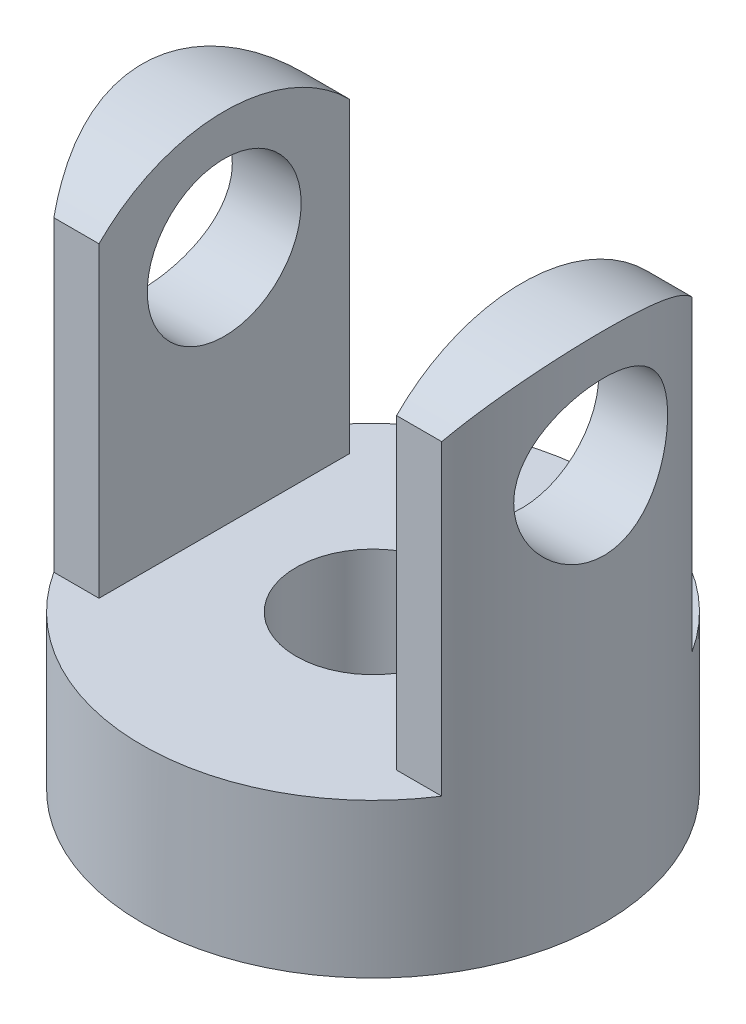
ISO-10303-21;
HEADER;
FILE_DESCRIPTION(('STEP AP214'),'2;1');
FILE_NAME('part.step','',(''),(''),'','','');
FILE_SCHEMA(('AUTOMOTIVE_DESIGN { 1 0 10303 214 1 1 1 1 }'));
ENDSEC;
DATA;
#1=APPLICATION_CONTEXT('core data for automotive mechanical design processes');
#2=APPLICATION_PROTOCOL_DEFINITION('international standard','automotive_design',2000,#1);
#3=PRODUCT_CONTEXT('',#1,'mechanical');
#4=PRODUCT('Part','Part','',(#3));
#5=PRODUCT_RELATED_PRODUCT_CATEGORY('part','',(#4));
#6=PRODUCT_DEFINITION_FORMATION('','',#4);
#7=PRODUCT_DEFINITION_CONTEXT('part definition',#1,'design');
#8=PRODUCT_DEFINITION('design','',#6,#7);
#9=PRODUCT_DEFINITION_SHAPE('','',#8);
#10=(LENGTH_UNIT() NAMED_UNIT(*) SI_UNIT(.MILLI.,.METRE.));
#11=(NAMED_UNIT(*) PLANE_ANGLE_UNIT() SI_UNIT($,.RADIAN.));
#12=(NAMED_UNIT(*) SI_UNIT($,.STERADIAN.) SOLID_ANGLE_UNIT());
#13=UNCERTAINTY_MEASURE_WITH_UNIT(LENGTH_MEASURE(1.E-05),#10,'distance_accuracy_value','');
#14=(GEOMETRIC_REPRESENTATION_CONTEXT(3) GLOBAL_UNCERTAINTY_ASSIGNED_CONTEXT((#13)) GLOBAL_UNIT_ASSIGNED_CONTEXT((#10,
#11,#12)) REPRESENTATION_CONTEXT('',''));
#15=CARTESIAN_POINT('',(0.,0.,0.));
#16=DIRECTION('',(0.,0.,1.));
#17=DIRECTION('',(1.,0.,0.));
#18=AXIS2_PLACEMENT_3D('',#15,#16,#17);
#19=CARTESIAN_POINT('',(0.,3.,0.));
#20=DIRECTION('',(0.,-1.,0.));
#21=DIRECTION('',(0.,0.,-1.));
#22=AXIS2_PLACEMENT_3D('',#19,#20,#21);
#23=CYLINDRICAL_SURFACE('',#22,4.5);
#24=CARTESIAN_POINT('',(4.24264068711929,7.7,1.5));
#25=CARTESIAN_POINT('',(4.24264041795651,7.61829773774589,1.50000038692157));
#26=CARTESIAN_POINT('',(4.24502653936286,7.53659780026461,1.49330217552829));
#27=CARTESIAN_POINT('',(4.25426361121882,7.37561836850863,1.46677669753321));
#28=CARTESIAN_POINT('',(4.26111529713283,7.2963392751913,1.4469472682526));
#29=CARTESIAN_POINT('',(4.27842305533187,7.14255966050407,1.39493322852736));
#30=CARTESIAN_POINT('',(4.28887205956983,7.06805010583593,1.36277283210487));
#31=CARTESIAN_POINT('',(4.31218683015487,6.92545992717806,1.28709244266207));
#32=CARTESIAN_POINT('',(4.32505312955418,6.85738072616955,1.24356994329028));
#33=CARTESIAN_POINT('',(4.3523173411121,6.72692005649253,1.14457671966432));
#34=CARTESIAN_POINT('',(4.36675342266966,6.66482685699241,1.08873651206688));
#35=CARTESIAN_POINT('',(4.39520797201504,6.55068979816304,0.967481500821593));
#36=CARTESIAN_POINT('',(4.40922637243442,6.49864755262645,0.902065162578564));
#37=CARTESIAN_POINT('',(4.43570800382699,6.40478165400561,0.761406761947516));
#38=CARTESIAN_POINT('',(4.44812111552408,6.36326004407306,0.685952866836789));
#39=CARTESIAN_POINT('',(4.46954380156474,6.29361262230873,0.528646834481212));
#40=CARTESIAN_POINT('',(4.47855429304502,6.26548320023464,0.446796428530819));
#41=CARTESIAN_POINT('',(4.49188613147861,6.22439621805141,0.282043226150242));
#42=CARTESIAN_POINT('',(4.49635972166341,6.21094483061449,0.199276132279452));
#43=CARTESIAN_POINT('',(4.5006541232737,6.19802555995901,0.0325468122361365));
#44=CARTESIAN_POINT('',(4.50047613394336,6.19855407252137,-0.0514151003158389));
#45=CARTESIAN_POINT('',(4.49559059428104,6.21326638184905,-0.214655272790726));
#46=CARTESIAN_POINT('',(4.49106097132703,6.22691379271176,-0.2939880728875));
#47=CARTESIAN_POINT('',(4.47820451009571,6.26658947147068,-0.449165158233241));
#48=CARTESIAN_POINT('',(4.46987741446672,6.29261857846963,-0.525009206668763));
#49=CARTESIAN_POINT('',(4.45013505439938,6.3566319759592,-0.67222871226302));
#50=CARTESIAN_POINT('',(4.43868063786404,6.39476890782017,-0.743532331453497));
#51=CARTESIAN_POINT('',(4.41387589557997,6.48178955817259,-0.878886488290753));
#52=CARTESIAN_POINT('',(4.40052504300777,6.53067626498996,-0.942935001577153));
#53=CARTESIAN_POINT('',(4.37259287776335,6.64051159019111,-1.06515129982786));
#54=CARTESIAN_POINT('',(4.35798322759,6.70191973676816,-1.12290023560133));
#55=CARTESIAN_POINT('',(4.32971002867667,6.83367308858399,-1.22741588939383));
#56=CARTESIAN_POINT('',(4.31604662597175,6.90401966856986,-1.27418091490951));
#57=CARTESIAN_POINT('',(4.29105787703297,7.05298043842312,-1.3559811825641));
#58=CARTESIAN_POINT('',(4.27976864008232,7.13169819705172,-1.39083969547657));
#59=CARTESIAN_POINT('',(4.26122476317449,7.29435709139939,-1.44666478994926));
#60=CARTESIAN_POINT('',(4.25396843251835,7.37829602183274,-1.46763719363329));
#61=CARTESIAN_POINT('',(4.24469454453105,7.54495753310093,-1.49424192313571));
#62=CARTESIAN_POINT('',(4.24245540472709,7.62756413711859,-1.50052364325862));
#63=CARTESIAN_POINT('',(4.24285008094201,7.79266422367556,-1.49940815836741));
#64=CARTESIAN_POINT('',(4.24548301189152,7.87515772403714,-1.49201343784089));
#65=CARTESIAN_POINT('',(4.25510427134068,8.03473544856674,-1.46433847732774));
#66=CARTESIAN_POINT('',(4.2619398816089,8.11190814522596,-1.44450959097083));
#67=CARTESIAN_POINT('',(4.27902830506905,8.26181540935908,-1.39307079384089));
#68=CARTESIAN_POINT('',(4.2892817240236,8.33454918738625,-1.36145879454518));
#69=CARTESIAN_POINT('',(4.31245316393577,8.47607063127041,-1.28621151110835));
#70=CARTESIAN_POINT('',(4.32544538498415,8.54465996396268,-1.24222667753773));
#71=CARTESIAN_POINT('',(4.35248653096476,8.6737190785756,-1.14387844583635));
#72=CARTESIAN_POINT('',(4.36653576665699,8.73418645799184,-1.08951198824817));
#73=CARTESIAN_POINT('',(4.39492557956766,8.84829197613595,-0.968837558850481));
#74=CARTESIAN_POINT('',(4.40924765366843,8.90146158502827,-0.902080905819974));
#75=CARTESIAN_POINT('',(4.43590277419665,8.99587421352207,-0.760240937100383));
#76=CARTESIAN_POINT('',(4.44823589126543,9.03711765674364,-0.685157917296826));
#77=CARTESIAN_POINT('',(4.46946608715904,9.10613015729257,-0.529169793648441));
#78=CARTESIAN_POINT('',(4.47838545006797,9.1339869157221,-0.448306684981793));
#79=CARTESIAN_POINT('',(4.49187916256662,9.17559161309016,-0.282687698769022));
#80=CARTESIAN_POINT('',(4.49645508051028,9.18934464482076,-0.197933237930832));
#81=CARTESIAN_POINT('',(4.50062794854384,9.20189311640846,-0.031223003790059));
#82=CARTESIAN_POINT('',(4.50044880134159,9.20136118089857,0.0506770858800301));
#83=CARTESIAN_POINT('',(4.49568294779097,9.18701403778039,0.213166717500263));
#84=CARTESIAN_POINT('',(4.49109659900364,9.17319990777085,0.293756365228587));
#85=CARTESIAN_POINT('',(4.47811372431618,9.13312664813606,0.45006317914809));
#86=CARTESIAN_POINT('',(4.46977887541723,9.1070686769706,0.525837406369186));
#87=CARTESIAN_POINT('',(4.45015741056742,9.04343370335427,0.671967526409695));
#88=CARTESIAN_POINT('',(4.43887026072025,9.00585461720448,0.74232243621365));
#89=CARTESIAN_POINT('',(4.41398803241821,8.91864573184699,0.87845102446318));
#90=CARTESIAN_POINT('',(4.4003230873789,8.86862197192754,0.943959377336413));
#91=CARTESIAN_POINT('',(4.37239483187819,8.75861391326571,1.06587153940864));
#92=CARTESIAN_POINT('',(4.35813133159646,8.69862643660591,1.12227243243689));
#93=CARTESIAN_POINT('',(4.32994919738397,8.56758596661958,1.22661271324968));
#94=CARTESIAN_POINT('',(4.31606591982946,8.49619173353504,1.27413444899685));
#95=CARTESIAN_POINT('',(4.29090289984523,8.34599835964583,1.35647151495167));
#96=CARTESIAN_POINT('',(4.27962247741874,8.2672011604555,1.39129016522921));
#97=CARTESIAN_POINT('',(4.26152001309772,8.10805726397655,1.44576574230625));
#98=CARTESIAN_POINT('',(4.25451949285773,8.02794160471195,1.46603686372428));
#99=CARTESIAN_POINT('',(4.24508075309277,7.86521592429995,1.4931514802239));
#100=CARTESIAN_POINT('',(4.24264095926192,7.78260677388394,1.49999960879489));
#101=CARTESIAN_POINT('',(4.24264068711929,7.7,1.5));
#102=B_SPLINE_CURVE_WITH_KNOTS('',3,(#24,#25,#26,#27,#28,#29,#30,#31,#32,#33,#34,#35,#36,#37,
#38,#39,#40,#41,#42,#43,#44,#45,#46,#47,#48,#49,#50,#51,#52,#53,#54,#55,#56,#57,#58,#59,#60,#61,
#62,#63,#64,#65,#66,#67,#68,#69,#70,#71,#72,#73,#74,#75,#76,#77,#78,#79,#80,#81,#82,#83,#84,#85,
#86,#87,#88,#89,#90,#91,#92,#93,#94,#95,#96,#97,#98,#99,#100,#101),.UNSPECIFIED.,.T.,.F.,(4,2,2,
2,2,2,2,2,2,2,2,2,2,2,2,2,2,2,2,2,2,2,2,2,2,2,2,2,2,2,2,2,2,2,2,2,2,2,4),(0.,0.244800877199033,
0.489642082522746,0.734004941251242,0.978421749278163,1.23152006141352,1.48465897757982,
1.74440259215486,2.00407614580184,2.25471478147401,2.50528879953491,2.74603507238354,
2.98679766283855,3.23072482290503,3.47471987811033,3.73020261545876,3.98572469418159,
4.24488959763007,4.50394577031475,4.75131437043211,4.99863803752402,5.23746593649716,
5.4763361871697,5.72278286600124,5.96930228489743,6.22768212253191,6.4860527813285,
6.74270686782829,6.99926824502787,7.24377127013005,7.48825446011223,7.72885434057197,
7.96949776141416,8.21903279277502,8.46864756645499,8.72803354100769,8.98735167396852,
9.23494818240588,9.48245920782247),.UNSPECIFIED.);
#103=CARTESIAN_POINT('',(4.24264068711929,7.7,1.5));
#104=VERTEX_POINT('',#103);
#105=EDGE_CURVE('E238',#104,#104,#102,.T.);
#106=ORIENTED_EDGE('',*,*,#105,.F.);
#107=EDGE_LOOP('',(#106));
#108=FACE_BOUND('',#107,.T.);
#109=CARTESIAN_POINT('',(0.,0.,0.));
#110=DIRECTION('',(0.,1.,0.));
#111=DIRECTION('',(0.,0.,1.));
#112=AXIS2_PLACEMENT_3D('',#109,#110,#111);
#113=CIRCLE('',#112,4.5);
#114=CARTESIAN_POINT('',(0.,0.,4.5));
#115=VERTEX_POINT('',#114);
#116=EDGE_CURVE('E121',#115,#115,#113,.T.);
#117=ORIENTED_EDGE('',*,*,#116,.T.);
#118=EDGE_LOOP('',(#117));
#119=FACE_BOUND('',#118,.T.);
#120=CARTESIAN_POINT('',(-4.24264068711929,7.7,-1.5));
#121=CARTESIAN_POINT('',(-4.24264041795651,7.78170226225411,-1.50000038692157));
#122=CARTESIAN_POINT('',(-4.24502653936286,7.86340219973539,-1.49330217552828));
#123=CARTESIAN_POINT('',(-4.25426361121882,8.02438163149137,-1.46677669753321));
#124=CARTESIAN_POINT('',(-4.26111529713283,8.10366072480871,-1.44694726825259));
#125=CARTESIAN_POINT('',(-4.27842305533187,8.25744033949593,-1.39493322852736));
#126=CARTESIAN_POINT('',(-4.28887205956983,8.33194989416408,-1.36277283210487));
#127=CARTESIAN_POINT('',(-4.31218683015487,8.47454007282194,-1.28709244266207));
#128=CARTESIAN_POINT('',(-4.32505312955419,8.54261927383045,-1.24356994329027));
#129=CARTESIAN_POINT('',(-4.3523173411121,8.67307994350747,-1.14457671966431));
#130=CARTESIAN_POINT('',(-4.36675342266966,8.73517314300759,-1.08873651206688));
#131=CARTESIAN_POINT('',(-4.39520797201504,8.84931020183696,-0.967481500821591));
#132=CARTESIAN_POINT('',(-4.40922637243442,8.90135244737355,-0.902065162578562));
#133=CARTESIAN_POINT('',(-4.43570800382699,8.99521834599439,-0.761406761947514));
#134=CARTESIAN_POINT('',(-4.44812111552408,9.03673995592694,-0.685952866836787));
#135=CARTESIAN_POINT('',(-4.46954380156474,9.10638737769126,-0.52864683448121));
#136=CARTESIAN_POINT('',(-4.47855429304502,9.13451679976536,-0.446796428530817));
#137=CARTESIAN_POINT('',(-4.49188613147861,9.17560378194859,-0.28204322615024));
#138=CARTESIAN_POINT('',(-4.49635972166341,9.18905516938551,-0.19927613227945));
#139=CARTESIAN_POINT('',(-4.5006541232737,9.20197444004099,-0.0325468122361343));
#140=CARTESIAN_POINT('',(-4.50047613394336,9.20144592747863,0.0514151003158412));
#141=CARTESIAN_POINT('',(-4.49559059428104,9.18673361815095,0.214655272790728));
#142=CARTESIAN_POINT('',(-4.49106097132703,9.17308620728824,0.293988072887502));
#143=CARTESIAN_POINT('',(-4.47820451009571,9.13341052852932,0.449165158233243));
#144=CARTESIAN_POINT('',(-4.46987741446672,9.10738142153037,0.525009206668765));
#145=CARTESIAN_POINT('',(-4.45013505439938,9.04336802404081,0.672228712263021));
#146=CARTESIAN_POINT('',(-4.43868063786404,9.00523109217983,0.743532331453498));
#147=CARTESIAN_POINT('',(-4.41387589557997,8.91821044182741,0.878886488290755));
#148=CARTESIAN_POINT('',(-4.40052504300777,8.86932373501004,0.942935001577155));
#149=CARTESIAN_POINT('',(-4.37259287776335,8.7594884098089,1.06515129982786));
#150=CARTESIAN_POINT('',(-4.35798322759,8.69808026323184,1.12290023560133));
#151=CARTESIAN_POINT('',(-4.32971002867667,8.56632691141601,1.22741588939384));
#152=CARTESIAN_POINT('',(-4.31604662597175,8.49598033143014,1.27418091490951));
#153=CARTESIAN_POINT('',(-4.29105787703296,8.34701956157688,1.3559811825641));
#154=CARTESIAN_POINT('',(-4.27976864008232,8.26830180294828,1.39083969547658));
#155=CARTESIAN_POINT('',(-4.26122476317448,8.10564290860061,1.44666478994926));
#156=CARTESIAN_POINT('',(-4.25396843251835,8.02170397816726,1.4676371936333));
#157=CARTESIAN_POINT('',(-4.24469454453105,7.85504246689907,1.49424192313571));
#158=CARTESIAN_POINT('',(-4.24245540472709,7.77243586288141,1.50052364325862));
#159=CARTESIAN_POINT('',(-4.24285008094201,7.60733577632444,1.49940815836741));
#160=CARTESIAN_POINT('',(-4.24548301189152,7.52484227596286,1.49201343784089));
#161=CARTESIAN_POINT('',(-4.25510427134068,7.36526455143326,1.46433847732775));
#162=CARTESIAN_POINT('',(-4.2619398816089,7.28809185477404,1.44450959097083));
#163=CARTESIAN_POINT('',(-4.27902830506905,7.13818459064092,1.3930707938409));
#164=CARTESIAN_POINT('',(-4.2892817240236,7.06545081261375,1.36145879454519));
#165=CARTESIAN_POINT('',(-4.31245316393576,6.92392936872959,1.28621151110835));
#166=CARTESIAN_POINT('',(-4.32544538498415,6.85534003603732,1.24222667753773));
#167=CARTESIAN_POINT('',(-4.35248653096476,6.7262809214244,1.14387844583635));
#168=CARTESIAN_POINT('',(-4.36653576665699,6.66581354200817,1.08951198824818));
#169=CARTESIAN_POINT('',(-4.39492557956765,6.55170802386405,0.968837558850486));
#170=CARTESIAN_POINT('',(-4.40924765366843,6.49853841497173,0.902080905819979));
#171=CARTESIAN_POINT('',(-4.43590277419665,6.40412578647793,0.760240937100387));
#172=CARTESIAN_POINT('',(-4.44823589126543,6.36288234325636,0.68515791729683));
#173=CARTESIAN_POINT('',(-4.46946608715904,6.29386984270743,0.529169793648444));
#174=CARTESIAN_POINT('',(-4.47838545006797,6.2660130842779,0.448306684981796));
#175=CARTESIAN_POINT('',(-4.49187916256662,6.22440838690984,0.282687698769026));
#176=CARTESIAN_POINT('',(-4.49645508051028,6.21065535517925,0.197933237930836));
#177=CARTESIAN_POINT('',(-4.50062794854384,6.19810688359154,0.0312230037900629));
#178=CARTESIAN_POINT('',(-4.50044880134159,6.19863881910143,-0.0506770858800264));
#179=CARTESIAN_POINT('',(-4.49568294779097,6.21298596221961,-0.213166717500259));
#180=CARTESIAN_POINT('',(-4.49109659900364,6.22680009222915,-0.293756365228584));
#181=CARTESIAN_POINT('',(-4.47811372431619,6.26687335186394,-0.450063179148087));
#182=CARTESIAN_POINT('',(-4.46977887541723,6.2929313230294,-0.525837406369182));
#183=CARTESIAN_POINT('',(-4.45015741056742,6.35656629664573,-0.671967526409691));
#184=CARTESIAN_POINT('',(-4.43887026072025,6.39414538279552,-0.742322436213647));
#185=CARTESIAN_POINT('',(-4.41398803241822,6.48135426815301,-0.878451024463176));
#186=CARTESIAN_POINT('',(-4.4003230873789,6.53137802807246,-0.943959377336409));
#187=CARTESIAN_POINT('',(-4.37239483187819,6.64138608673429,-1.06587153940864));
#188=CARTESIAN_POINT('',(-4.35813133159646,6.70137356339409,-1.12227243243689));
#189=CARTESIAN_POINT('',(-4.32994919738397,6.83241403338042,-1.22661271324967));
#190=CARTESIAN_POINT('',(-4.31606591982946,6.90380826646496,-1.27413444899685));
#191=CARTESIAN_POINT('',(-4.29090289984523,7.05400164035417,-1.35647151495167));
#192=CARTESIAN_POINT('',(-4.27962247741874,7.1327988395445,-1.39129016522921));
#193=CARTESIAN_POINT('',(-4.26152001309772,7.29194273602345,-1.44576574230625));
#194=CARTESIAN_POINT('',(-4.25451949285773,7.37205839528805,-1.46603686372428));
#195=CARTESIAN_POINT('',(-4.24508075309277,7.53478407570005,-1.4931514802239));
#196=CARTESIAN_POINT('',(-4.24264095926192,7.61739322611606,-1.49999960879489));
#197=CARTESIAN_POINT('',(-4.24264068711929,7.7,-1.5));
#198=B_SPLINE_CURVE_WITH_KNOTS('',3,(#120,#121,#122,#123,#124,#125,#126,#127,#128,#129,#130,
#131,#132,#133,#134,#135,#136,#137,#138,#139,#140,#141,#142,#143,#144,#145,#146,#147,#148,#149,
#150,#151,#152,#153,#154,#155,#156,#157,#158,#159,#160,#161,#162,#163,#164,#165,#166,#167,#168,
#169,#170,#171,#172,#173,#174,#175,#176,#177,#178,#179,#180,#181,#182,#183,#184,#185,#186,#187,
#188,#189,#190,#191,#192,#193,#194,#195,#196,#197),.UNSPECIFIED.,.T.,.F.,(4,2,2,2,2,2,2,2,2,2,2,
2,2,2,2,2,2,2,2,2,2,2,2,2,2,2,2,2,2,2,2,2,2,2,2,2,2,2,4),(0.,0.244800877199033,
0.489642082522746,0.734004941251243,0.978421749278165,1.23152006141352,1.48465897757982,
1.74440259215485,2.00407614580184,2.25471478147401,2.50528879953491,2.74603507238353,
2.98679766283855,3.23072482290502,3.47471987811033,3.73020261545876,3.98572469418159,
4.24488959763007,4.50394577031475,4.75131437043211,4.99863803752402,5.23746593649716,
5.4763361871697,5.72278286600124,5.96930228489743,6.22768212253191,6.4860527813285,
6.74270686782829,6.99926824502786,7.24377127013005,7.48825446011223,7.72885434057196,
7.96949776141415,8.21903279277502,8.46864756645499,8.72803354100769,8.98735167396852,
9.23494818240588,9.48245920782247),.UNSPECIFIED.);
#199=CARTESIAN_POINT('',(-4.24264068711929,7.7,-1.5));
#200=VERTEX_POINT('',#199);
#201=EDGE_CURVE('E279',#200,#200,#198,.T.);
#202=ORIENTED_EDGE('',*,*,#201,.T.);
#203=EDGE_LOOP('',(#202));
#204=FACE_BOUND('',#203,.T.);
#205=DIRECTION('',(0.,-1.,0.));
#206=VECTOR('',#205,1.);
#207=CARTESIAN_POINT('',(3.78045767250926,3.,2.44093010681705));
#208=LINE('',#207,#206);
#209=CARTESIAN_POINT('',(3.78045767250926,8.98432456303395,2.44093010681705));
#210=VERTEX_POINT('',#209);
#211=CARTESIAN_POINT('',(3.78045767250926,3.,2.44093010681705));
#212=VERTEX_POINT('',#211);
#213=EDGE_CURVE('E195',#210,#212,#208,.T.);
#214=ORIENTED_EDGE('',*,*,#213,.T.);
#215=CARTESIAN_POINT('',(0.,3.,0.));
#216=DIRECTION('',(0.,1.,0.));
#217=DIRECTION('',(0.,0.,1.));
#218=AXIS2_PLACEMENT_3D('',#215,#216,#217);
#219=CIRCLE('',#218,4.5);
#220=CARTESIAN_POINT('',(-3.78045767250926,3.,2.44093010681705));
#221=VERTEX_POINT('',#220);
#222=EDGE_CURVE('E12',#221,#212,#219,.T.);
#223=ORIENTED_EDGE('',*,*,#222,.F.);
#224=DIRECTION('',(0.,-1.,0.));
#225=VECTOR('',#224,1.);
#226=CARTESIAN_POINT('',(-3.78045767250926,3.,2.44093010681705));
#227=LINE('',#226,#225);
#228=CARTESIAN_POINT('',(-3.78045767250926,8.98432456303395,2.44093010681705));
#229=VERTEX_POINT('',#228);
#230=EDGE_CURVE('E349',#229,#221,#227,.T.);
#231=ORIENTED_EDGE('',*,*,#230,.F.);
#232=CARTESIAN_POINT('',(-3.78045767250926,8.98432456303395,-2.44093010681705));
#233=CARTESIAN_POINT('',(-3.82129808764914,9.04796539077915,-2.37768848346325));
#234=CARTESIAN_POINT('',(-3.86160091886856,9.10933518733429,-2.31177456393531));
#235=CARTESIAN_POINT('',(-3.94045222079088,9.227236667271,-2.17464570014162));
#236=CARTESIAN_POINT('',(-3.97899894194469,9.28376357316534,-2.10342564796291));
#237=CARTESIAN_POINT('',(-4.05399999099516,9.39217000715453,-1.95501359536928));
#238=CARTESIAN_POINT('',(-4.09042557204486,9.44398944062621,-1.87776294040435));
#239=CARTESIAN_POINT('',(-4.15995572937005,9.54175561687176,-1.71823600053725));
#240=CARTESIAN_POINT('',(-4.19306127955662,9.587704082949,-1.63596120089898));
#241=CARTESIAN_POINT('',(-4.25545010796492,9.67350860690278,-1.46607937272655));
#242=CARTESIAN_POINT('',(-4.2847047181669,9.71331931078511,-1.37843876776354));
#243=CARTESIAN_POINT('',(-4.33837842419744,9.78585196585244,-1.19885382760369));
#244=CARTESIAN_POINT('',(-4.3627985864229,9.81857548050071,-1.10691044707066));
#245=CARTESIAN_POINT('',(-4.40599905260438,9.87617529092297,-0.91995618059162));
#246=CARTESIAN_POINT('',(-4.42481336088157,9.9010989479747,-0.824967828493726));
#247=CARTESIAN_POINT('',(-4.45642327552007,9.94283924379885,-0.632302162585852));
#248=CARTESIAN_POINT('',(-4.46922361804823,9.95966226231226,-0.534627029083363));
#249=CARTESIAN_POINT('',(-4.48583361657635,9.98145752507035,-0.364067071860508));
#250=CARTESIAN_POINT('',(-4.49113469826357,9.98839920145618,-0.291570702811482));
#251=CARTESIAN_POINT('',(-4.49821939712544,9.99767237349753,-0.146051220935434));
#252=CARTESIAN_POINT('',(-4.50000027239976,10.0000002754728,-0.073027741935613));
#253=CARTESIAN_POINT('',(-4.49999968791486,9.99999968439417,0.0836670082562599));
#254=CARTESIAN_POINT('',(-4.49766143958691,9.9969434007097,0.167339612046363));
#255=CARTESIAN_POINT('',(-4.48836338392591,9.9847699540253,0.334016424341739));
#256=CARTESIAN_POINT('',(-4.48140143903928,9.97564998775826,0.417020305722023));
#257=CARTESIAN_POINT('',(-4.46300797459771,9.95148823799189,0.58174906988064));
#258=CARTESIAN_POINT('',(-4.45157181601851,9.93644030805621,0.663472533311028));
#259=CARTESIAN_POINT('',(-4.42449378698035,9.90066819280315,0.824969411863123));
#260=CARTESIAN_POINT('',(-4.40885008965021,9.87994154176882,0.904741963466213));
#261=CARTESIAN_POINT('',(-4.35632535258269,9.80999804114609,1.13925382308271));
#262=CARTESIAN_POINT('',(-4.31370465012354,9.75282942389645,1.29042765520538));
#263=CARTESIAN_POINT('',(-4.21624807857727,9.61991614679323,1.58009610101862));
#264=CARTESIAN_POINT('',(-4.16140027820106,9.54415333525473,1.71857814243455));
#265=CARTESIAN_POINT('',(-4.05313454412007,9.39108837231073,1.95865371832443));
#266=CARTESIAN_POINT('',(-4.00109211932057,9.31629050022767,2.06249594487397));
#267=CARTESIAN_POINT('',(-3.89319155733652,9.15719387756358,2.25957358698157));
#268=CARTESIAN_POINT('',(-3.83735174628353,9.07293963677048,2.35285485956757));
#269=CARTESIAN_POINT('',(-3.78045767250926,8.98432456303395,2.44093010681705));
#270=B_SPLINE_CURVE_WITH_KNOTS('',3,(#232,#233,#234,#235,#236,#237,#238,#239,#240,#241,#242,
#243,#244,#245,#246,#247,#248,#249,#250,#251,#252,#253,#254,#255,#256,#257,#258,#259,#260,#261,
#262,#263,#264,#265,#266,#267,#268,#269),.UNSPECIFIED.,.F.,.F.,(4,2,2,2,2,2,2,2,2,2,2,2,2,2,2,2,
2,2,4),(0.,0.295708318456004,0.591705071050467,0.891064628033968,1.19033611123747,
1.49172273088361,1.79304279551812,2.0924960357495,2.39171305120776,2.61055750534663,
2.82957235108617,3.08049503363179,3.33153379956994,3.58283354420669,3.83424257731129,
4.33332133993885,4.83288925564932,5.24656505459262,5.65836950789474),.UNSPECIFIED.);
#271=CARTESIAN_POINT('',(-3.78045767250926,8.98432456303395,-2.44093010681705));
#272=VERTEX_POINT('',#271);
#273=EDGE_CURVE('E271',#272,#229,#270,.T.);
#274=ORIENTED_EDGE('',*,*,#273,.F.);
#275=DIRECTION('',(0.,-1.,0.));
#276=VECTOR('',#275,1.);
#277=CARTESIAN_POINT('',(-3.78045767250926,3.,-2.44093010681705));
#278=LINE('',#277,#276);
#279=CARTESIAN_POINT('',(-3.78045767250926,3.,-2.44093010681705));
#280=VERTEX_POINT('',#279);
#281=EDGE_CURVE('E140',#272,#280,#278,.T.);
#282=ORIENTED_EDGE('',*,*,#281,.T.);
#283=CARTESIAN_POINT('',(3.78045767250926,3.,-2.44093010681705));
#284=VERTEX_POINT('',#283);
#285=EDGE_CURVE('E127',#284,#280,#219,.T.);
#286=ORIENTED_EDGE('',*,*,#285,.F.);
#287=DIRECTION('',(0.,-1.,0.));
#288=VECTOR('',#287,1.);
#289=CARTESIAN_POINT('',(3.78045767250926,3.,-2.44093010681705));
#290=LINE('',#289,#288);
#291=CARTESIAN_POINT('',(3.78045767250926,8.98432456303395,-2.44093010681705));
#292=VERTEX_POINT('',#291);
#293=EDGE_CURVE('E334',#292,#284,#290,.T.);
#294=ORIENTED_EDGE('',*,*,#293,.F.);
#295=CARTESIAN_POINT('',(3.78045767250926,8.98432456303395,-2.44093010681705));
#296=CARTESIAN_POINT('',(3.82129808764914,9.04796539077915,-2.37768848346325));
#297=CARTESIAN_POINT('',(3.86160091886856,9.10933518733429,-2.31177456393531));
#298=CARTESIAN_POINT('',(3.94045222079088,9.227236667271,-2.17464570014162));
#299=CARTESIAN_POINT('',(3.97899894194469,9.28376357316534,-2.10342564796291));
#300=CARTESIAN_POINT('',(4.05399999099516,9.39217000715453,-1.95501359536928));
#301=CARTESIAN_POINT('',(4.09042557204486,9.44398944062621,-1.87776294040435));
#302=CARTESIAN_POINT('',(4.15995572937005,9.54175561687176,-1.71823600053725));
#303=CARTESIAN_POINT('',(4.19306127955662,9.587704082949,-1.63596120089898));
#304=CARTESIAN_POINT('',(4.25545010796492,9.67350860690278,-1.46607937272655));
#305=CARTESIAN_POINT('',(4.2847047181669,9.71331931078511,-1.37843876776354));
#306=CARTESIAN_POINT('',(4.33837842419744,9.78585196585244,-1.19885382760369));
#307=CARTESIAN_POINT('',(4.3627985864229,9.81857548050071,-1.10691044707066));
#308=CARTESIAN_POINT('',(4.40599905260438,9.87617529092297,-0.91995618059162));
#309=CARTESIAN_POINT('',(4.42481336088157,9.9010989479747,-0.824967828493726));
#310=CARTESIAN_POINT('',(4.45642327552007,9.94283924379885,-0.632302162585852));
#311=CARTESIAN_POINT('',(4.46922361804822,9.95966226231226,-0.534627029083363));
#312=CARTESIAN_POINT('',(4.48583361657635,9.98145752507035,-0.364067071860508));
#313=CARTESIAN_POINT('',(4.49113469826357,9.98839920145618,-0.291570702811482));
#314=CARTESIAN_POINT('',(4.49821939712544,9.99767237349753,-0.146051220935434));
#315=CARTESIAN_POINT('',(4.50000027239976,10.0000002754728,-0.0730277419356127));
#316=CARTESIAN_POINT('',(4.49999968791486,9.99999968439417,0.0836670082562602));
#317=CARTESIAN_POINT('',(4.49766143958691,9.9969434007097,0.167339612046363));
#318=CARTESIAN_POINT('',(4.48836338392591,9.9847699540253,0.334016424341739));
#319=CARTESIAN_POINT('',(4.48140143903928,9.97564998775826,0.417020305722023));
#320=CARTESIAN_POINT('',(4.46300797459771,9.95148823799189,0.58174906988064));
#321=CARTESIAN_POINT('',(4.45157181601851,9.9364403080562,0.663472533311028));
#322=CARTESIAN_POINT('',(4.42449378698035,9.90066819280315,0.824969411863123));
#323=CARTESIAN_POINT('',(4.40885008965021,9.87994154176882,0.904741963466213));
#324=CARTESIAN_POINT('',(4.35632535258269,9.80999804114609,1.13925382308271));
#325=CARTESIAN_POINT('',(4.31370465012354,9.75282942389645,1.29042765520538));
#326=CARTESIAN_POINT('',(4.21624807857727,9.61991614679323,1.58009610101862));
#327=CARTESIAN_POINT('',(4.16140027820106,9.54415333525473,1.71857814243455));
#328=CARTESIAN_POINT('',(4.05313454412007,9.39108837231073,1.95865371832443));
#329=CARTESIAN_POINT('',(4.00109211932057,9.31629050022767,2.06249594487397));
#330=CARTESIAN_POINT('',(3.89319155733652,9.15719387756358,2.25957358698157));
#331=CARTESIAN_POINT('',(3.83735174628353,9.07293963677048,2.35285485956757));
#332=CARTESIAN_POINT('',(3.78045767250926,8.98432456303395,2.44093010681705));
#333=B_SPLINE_CURVE_WITH_KNOTS('',3,(#295,#296,#297,#298,#299,#300,#301,#302,#303,#304,#305,
#306,#307,#308,#309,#310,#311,#312,#313,#314,#315,#316,#317,#318,#319,#320,#321,#322,#323,#324,
#325,#326,#327,#328,#329,#330,#331,#332),.UNSPECIFIED.,.F.,.F.,(4,2,2,2,2,2,2,2,2,2,2,2,2,2,2,2,
2,2,4),(0.,0.295708318456005,0.591705071050467,0.891064628033969,1.19033611123747,
1.49172273088361,1.79304279551812,2.0924960357495,2.39171305120777,2.61055750534663,
2.82957235108617,3.08049503363179,3.33153379956994,3.58283354420669,3.83424257731129,
4.33332133993885,4.83288925564932,5.24656505459262,5.65836950789474),.UNSPECIFIED.);
#334=EDGE_CURVE('E230',#292,#210,#333,.T.);
#335=ORIENTED_EDGE('',*,*,#334,.T.);
#336=EDGE_LOOP('',(#214,#223,#231,#274,#282,#286,#294,#335));
#337=FACE_BOUND('',#336,.T.);
#338=ADVANCED_FACE('F117',(#108,#119,#204,#337),#23,.T.);
#339=CARTESIAN_POINT('',(2.9,10.,0.));
#340=DIRECTION('',(-1.,0.,0.));
#341=DIRECTION('',(0.,0.,1.));
#342=AXIS2_PLACEMENT_3D('',#339,#340,#341);
#343=PLANE('',#342);
#344=DIRECTION('',(0.,-1.,0.));
#345=VECTOR('',#344,1.);
#346=CARTESIAN_POINT('',(2.9,0.,2.44093010681705));
#347=LINE('',#346,#345);
#348=CARTESIAN_POINT('',(2.9,8.98432456303395,2.44093010681705));
#349=VERTEX_POINT('',#348);
#350=CARTESIAN_POINT('',(2.9,3.,2.44093010681705));
#351=VERTEX_POINT('',#350);
#352=EDGE_CURVE('E202',#349,#351,#347,.T.);
#353=ORIENTED_EDGE('',*,*,#352,.F.);
#354=CARTESIAN_POINT('',(2.9,6.55906989318295,0.));
#355=DIRECTION('',(1.,0.,0.));
#356=DIRECTION('',(0.,0.,-1.));
#357=AXIS2_PLACEMENT_3D('',#354,#355,#356);
#358=CIRCLE('',#357,3.44093010681705);
#359=CARTESIAN_POINT('',(2.9,8.98432456303395,-2.44093010681705));
#360=VERTEX_POINT('',#359);
#361=EDGE_CURVE('E183',#360,#349,#358,.T.);
#362=ORIENTED_EDGE('',*,*,#361,.F.);
#363=DIRECTION('',(0.,-1.,0.));
#364=VECTOR('',#363,1.);
#365=CARTESIAN_POINT('',(2.9,0.,-2.44093010681705));
#366=LINE('',#365,#364);
#367=CARTESIAN_POINT('',(2.9,3.,-2.44093010681705));
#368=VERTEX_POINT('',#367);
#369=EDGE_CURVE('E194',#360,#368,#366,.T.);
#370=ORIENTED_EDGE('',*,*,#369,.T.);
#371=DIRECTION('',(0.,0.,-1.));
#372=VECTOR('',#371,1.);
#373=CARTESIAN_POINT('',(2.9,3.,0.));
#374=LINE('',#373,#372);
#375=EDGE_CURVE('E210',#351,#368,#374,.T.);
#376=ORIENTED_EDGE('',*,*,#375,.F.);
#377=EDGE_LOOP('',(#353,#362,#370,#376));
#378=FACE_BOUND('',#377,.T.);
#379=CARTESIAN_POINT('',(2.9,7.7,0.));
#380=DIRECTION('',(1.,0.,0.));
#381=DIRECTION('',(0.,0.,-1.));
#382=AXIS2_PLACEMENT_3D('',#379,#380,#381);
#383=CIRCLE('',#382,1.5);
#384=CARTESIAN_POINT('',(2.9,7.7,-1.5));
#385=VERTEX_POINT('',#384);
#386=EDGE_CURVE('E223',#385,#385,#383,.T.);
#387=ORIENTED_EDGE('',*,*,#386,.T.);
#388=EDGE_LOOP('',(#387));
#389=FACE_BOUND('',#388,.T.);
#390=ADVANCED_FACE('F208',(#378,#389),#343,.T.);
#391=CARTESIAN_POINT('',(-2.9,10.,0.));
#392=DIRECTION('',(-1.,0.,0.));
#393=DIRECTION('',(0.,0.,1.));
#394=AXIS2_PLACEMENT_3D('',#391,#392,#393);
#395=PLANE('',#394);
#396=CARTESIAN_POINT('',(-2.9,7.7,0.));
#397=DIRECTION('',(1.,0.,0.));
#398=DIRECTION('',(0.,0.,-1.));
#399=AXIS2_PLACEMENT_3D('',#396,#397,#398);
#400=CIRCLE('',#399,1.5);
#401=CARTESIAN_POINT('',(-2.9,7.7,-1.5));
#402=VERTEX_POINT('',#401);
#403=EDGE_CURVE('E280',#402,#402,#400,.T.);
#404=ORIENTED_EDGE('',*,*,#403,.F.);
#405=EDGE_LOOP('',(#404));
#406=FACE_BOUND('',#405,.T.);
#407=CARTESIAN_POINT('',(-2.9,6.55906989318295,0.));
#408=DIRECTION('',(1.,0.,0.));
#409=DIRECTION('',(0.,0.,-1.));
#410=AXIS2_PLACEMENT_3D('',#407,#408,#409);
#411=CIRCLE('',#410,3.44093010681705);
#412=CARTESIAN_POINT('',(-2.9,8.98432456303395,-2.44093010681705));
#413=VERTEX_POINT('',#412);
#414=CARTESIAN_POINT('',(-2.9,8.98432456303395,2.44093010681705));
#415=VERTEX_POINT('',#414);
#416=EDGE_CURVE('E355',#413,#415,#411,.T.);
#417=ORIENTED_EDGE('',*,*,#416,.T.);
#418=DIRECTION('',(0.,-1.,0.));
#419=VECTOR('',#418,1.);
#420=CARTESIAN_POINT('',(-2.9,0.,2.44093010681705));
#421=LINE('',#420,#419);
#422=CARTESIAN_POINT('',(-2.9,3.,2.44093010681705));
#423=VERTEX_POINT('',#422);
#424=EDGE_CURVE('E344',#415,#423,#421,.T.);
#425=ORIENTED_EDGE('',*,*,#424,.T.);
#426=DIRECTION('',(0.,0.,-1.));
#427=VECTOR('',#426,1.);
#428=CARTESIAN_POINT('',(-2.9,3.,0.));
#429=LINE('',#428,#427);
#430=CARTESIAN_POINT('',(-2.9,3.,-2.44093010681705));
#431=VERTEX_POINT('',#430);
#432=EDGE_CURVE('E292',#423,#431,#429,.T.);
#433=ORIENTED_EDGE('',*,*,#432,.T.);
#434=DIRECTION('',(0.,-1.,0.));
#435=VECTOR('',#434,1.);
#436=CARTESIAN_POINT('',(-2.9,0.,-2.44093010681705));
#437=LINE('',#436,#435);
#438=EDGE_CURVE('E358',#413,#431,#437,.T.);
#439=ORIENTED_EDGE('',*,*,#438,.F.);
#440=EDGE_LOOP('',(#417,#425,#433,#439));
#441=FACE_BOUND('',#440,.T.);
#442=ADVANCED_FACE('F321',(#406,#441),#395,.F.);
#443=CARTESIAN_POINT('',(0.,3.,0.));
#444=DIRECTION('',(0.,1.,0.));
#445=DIRECTION('',(0.,0.,1.));
#446=AXIS2_PLACEMENT_3D('',#443,#444,#445);
#447=PLANE('',#446);
#448=ORIENTED_EDGE('',*,*,#222,.T.);
#449=DIRECTION('',(-1.,0.,0.));
#450=VECTOR('',#449,1.);
#451=CARTESIAN_POINT('',(9.4,3.,2.44093010681705));
#452=LINE('',#451,#450);
#453=EDGE_CURVE('E206',#212,#351,#452,.T.);
#454=ORIENTED_EDGE('',*,*,#453,.T.);
#455=ORIENTED_EDGE('',*,*,#375,.T.);
#456=DIRECTION('',(-1.,0.,0.));
#457=VECTOR('',#456,1.);
#458=CARTESIAN_POINT('',(9.4,3.,-2.44093010681705));
#459=LINE('',#458,#457);
#460=EDGE_CURVE('E220',#284,#368,#459,.T.);
#461=ORIENTED_EDGE('',*,*,#460,.F.);
#462=ORIENTED_EDGE('',*,*,#285,.T.);
#463=DIRECTION('',(1.,0.,0.));
#464=VECTOR('',#463,1.);
#465=CARTESIAN_POINT('',(-9.4,3.,-2.44093010681705));
#466=LINE('',#465,#464);
#467=EDGE_CURVE('E363',#280,#431,#466,.T.);
#468=ORIENTED_EDGE('',*,*,#467,.T.);
#469=ORIENTED_EDGE('',*,*,#432,.F.);
#470=DIRECTION('',(1.,0.,0.));
#471=VECTOR('',#470,1.);
#472=CARTESIAN_POINT('',(-9.4,3.,2.44093010681705));
#473=LINE('',#472,#471);
#474=EDGE_CURVE('E339',#221,#423,#473,.T.);
#475=ORIENTED_EDGE('',*,*,#474,.F.);
#476=EDGE_LOOP('',(#448,#454,#455,#461,#462,#468,#469,#475));
#477=FACE_BOUND('',#476,.T.);
#478=CARTESIAN_POINT('',(0.,3.,0.));
#479=DIRECTION('',(0.,1.,0.));
#480=DIRECTION('',(0.,0.,1.));
#481=AXIS2_PLACEMENT_3D('',#478,#479,#480);
#482=CIRCLE('',#481,1.5);
#483=CARTESIAN_POINT('',(0.,3.,1.5));
#484=VERTEX_POINT('',#483);
#485=EDGE_CURVE('E296',#484,#484,#482,.T.);
#486=ORIENTED_EDGE('',*,*,#485,.F.);
#487=EDGE_LOOP('',(#486));
#488=FACE_BOUND('',#487,.T.);
#489=ADVANCED_FACE('F312',(#477,#488),#447,.T.);
#490=CARTESIAN_POINT('',(0.,0.,0.));
#491=DIRECTION('',(0.,1.,0.));
#492=DIRECTION('',(0.,0.,1.));
#493=AXIS2_PLACEMENT_3D('',#490,#491,#492);
#494=PLANE('',#493);
#495=ORIENTED_EDGE('',*,*,#116,.F.);
#496=EDGE_LOOP('',(#495));
#497=FACE_BOUND('',#496,.T.);
#498=CARTESIAN_POINT('',(0.,0.,0.));
#499=DIRECTION('',(0.,1.,0.));
#500=DIRECTION('',(0.,0.,1.));
#501=AXIS2_PLACEMENT_3D('',#498,#499,#500);
#502=CIRCLE('',#501,1.5);
#503=CARTESIAN_POINT('',(0.,0.,1.5));
#504=VERTEX_POINT('',#503);
#505=EDGE_CURVE('E295',#504,#504,#502,.T.);
#506=ORIENTED_EDGE('',*,*,#505,.T.);
#507=EDGE_LOOP('',(#506));
#508=FACE_BOUND('',#507,.T.);
#509=ADVANCED_FACE('F304',(#497,#508),#494,.F.);
#510=CARTESIAN_POINT('',(0.,3.,0.));
#511=DIRECTION('',(0.,-1.,0.));
#512=DIRECTION('',(0.,0.,-1.));
#513=AXIS2_PLACEMENT_3D('',#510,#511,#512);
#514=CYLINDRICAL_SURFACE('',#513,1.5);
#515=ORIENTED_EDGE('',*,*,#485,.T.);
#516=EDGE_LOOP('',(#515));
#517=FACE_BOUND('',#516,.T.);
#518=ORIENTED_EDGE('',*,*,#505,.F.);
#519=EDGE_LOOP('',(#518));
#520=FACE_BOUND('',#519,.T.);
#521=ADVANCED_FACE('F263',(#517,#520),#514,.F.);
#522=CARTESIAN_POINT('',(-9.4,0.,-2.44093010681705));
#523=DIRECTION('',(0.,0.,1.));
#524=DIRECTION('',(1.,0.,0.));
#525=AXIS2_PLACEMENT_3D('',#522,#523,#524);
#526=PLANE('',#525);
#527=DIRECTION('',(1.,0.,0.));
#528=VECTOR('',#527,1.);
#529=CARTESIAN_POINT('',(-9.4,8.98432456303395,-2.44093010681705));
#530=LINE('',#529,#528);
#531=EDGE_CURVE('E362',#272,#413,#530,.T.);
#532=ORIENTED_EDGE('',*,*,#531,.T.);
#533=ORIENTED_EDGE('',*,*,#438,.T.);
#534=ORIENTED_EDGE('',*,*,#467,.F.);
#535=ORIENTED_EDGE('',*,*,#281,.F.);
#536=EDGE_LOOP('',(#532,#533,#534,#535));
#537=FACE_BOUND('',#536,.T.);
#538=ADVANCED_FACE('F259',(#537),#526,.F.);
#539=CARTESIAN_POINT('',(-9.4,6.55906989318295,0.));
#540=DIRECTION('',(1.,0.,0.));
#541=DIRECTION('',(0.,0.,-1.));
#542=AXIS2_PLACEMENT_3D('',#539,#540,#541);
#543=CYLINDRICAL_SURFACE('',#542,3.44093010681705);
#544=ORIENTED_EDGE('',*,*,#273,.T.);
#545=DIRECTION('',(1.,0.,0.));
#546=VECTOR('',#545,1.);
#547=CARTESIAN_POINT('',(-9.4,8.98432456303395,2.44093010681705));
#548=LINE('',#547,#546);
#549=EDGE_CURVE('E343',#229,#415,#548,.T.);
#550=ORIENTED_EDGE('',*,*,#549,.T.);
#551=ORIENTED_EDGE('',*,*,#416,.F.);
#552=ORIENTED_EDGE('',*,*,#531,.F.);
#553=EDGE_LOOP('',(#544,#550,#551,#552));
#554=FACE_BOUND('',#553,.T.);
#555=ADVANCED_FACE('F262',(#554),#543,.T.);
#556=CARTESIAN_POINT('',(-9.4,7.7,0.));
#557=DIRECTION('',(1.,0.,0.));
#558=DIRECTION('',(0.,0.,-1.));
#559=AXIS2_PLACEMENT_3D('',#556,#557,#558);
#560=CYLINDRICAL_SURFACE('',#559,1.5);
#561=ORIENTED_EDGE('',*,*,#403,.T.);
#562=EDGE_LOOP('',(#561));
#563=FACE_BOUND('',#562,.T.);
#564=ORIENTED_EDGE('',*,*,#201,.F.);
#565=EDGE_LOOP('',(#564));
#566=FACE_BOUND('',#565,.T.);
#567=ADVANCED_FACE('F257',(#563,#566),#560,.F.);
#568=CARTESIAN_POINT('',(-9.4,0.,2.44093010681705));
#569=DIRECTION('',(0.,0.,1.));
#570=DIRECTION('',(1.,0.,0.));
#571=AXIS2_PLACEMENT_3D('',#568,#569,#570);
#572=PLANE('',#571);
#573=ORIENTED_EDGE('',*,*,#230,.T.);
#574=ORIENTED_EDGE('',*,*,#474,.T.);
#575=ORIENTED_EDGE('',*,*,#424,.F.);
#576=ORIENTED_EDGE('',*,*,#549,.F.);
#577=EDGE_LOOP('',(#573,#574,#575,#576));
#578=FACE_BOUND('',#577,.T.);
#579=ADVANCED_FACE('F254',(#578),#572,.T.);
#580=CARTESIAN_POINT('',(9.4,0.,-2.44093010681705));
#581=DIRECTION('',(0.,0.,-1.));
#582=DIRECTION('',(-1.,0.,0.));
#583=AXIS2_PLACEMENT_3D('',#580,#581,#582);
#584=PLANE('',#583);
#585=ORIENTED_EDGE('',*,*,#293,.T.);
#586=ORIENTED_EDGE('',*,*,#460,.T.);
#587=ORIENTED_EDGE('',*,*,#369,.F.);
#588=DIRECTION('',(-1.,0.,0.));
#589=VECTOR('',#588,1.);
#590=CARTESIAN_POINT('',(9.4,8.98432456303395,-2.44093010681705));
#591=LINE('',#590,#589);
#592=EDGE_CURVE('E188',#292,#360,#591,.T.);
#593=ORIENTED_EDGE('',*,*,#592,.F.);
#594=EDGE_LOOP('',(#585,#586,#587,#593));
#595=FACE_BOUND('',#594,.T.);
#596=ADVANCED_FACE('F248',(#595),#584,.T.);
#597=CARTESIAN_POINT('',(9.4,6.55906989318295,0.));
#598=DIRECTION('',(-1.,0.,0.));
#599=DIRECTION('',(0.,0.,1.));
#600=AXIS2_PLACEMENT_3D('',#597,#598,#599);
#601=CYLINDRICAL_SURFACE('',#600,3.44093010681705);
#602=ORIENTED_EDGE('',*,*,#592,.T.);
#603=ORIENTED_EDGE('',*,*,#361,.T.);
#604=DIRECTION('',(-1.,0.,0.));
#605=VECTOR('',#604,1.);
#606=CARTESIAN_POINT('',(9.4,8.98432456303395,2.44093010681705));
#607=LINE('',#606,#605);
#608=EDGE_CURVE('E186',#210,#349,#607,.T.);
#609=ORIENTED_EDGE('',*,*,#608,.F.);
#610=ORIENTED_EDGE('',*,*,#334,.F.);
#611=EDGE_LOOP('',(#602,#603,#609,#610));
#612=FACE_BOUND('',#611,.T.);
#613=ADVANCED_FACE('F185',(#612),#601,.T.);
#614=CARTESIAN_POINT('',(9.4,7.7,0.));
#615=DIRECTION('',(-1.,0.,0.));
#616=DIRECTION('',(0.,0.,1.));
#617=AXIS2_PLACEMENT_3D('',#614,#615,#616);
#618=CYLINDRICAL_SURFACE('',#617,1.5);
#619=ORIENTED_EDGE('',*,*,#386,.F.);
#620=EDGE_LOOP('',(#619));
#621=FACE_BOUND('',#620,.T.);
#622=ORIENTED_EDGE('',*,*,#105,.T.);
#623=EDGE_LOOP('',(#622));
#624=FACE_BOUND('',#623,.T.);
#625=ADVANCED_FACE('F247',(#621,#624),#618,.F.);
#626=CARTESIAN_POINT('',(9.4,0.,2.44093010681705));
#627=DIRECTION('',(0.,0.,-1.));
#628=DIRECTION('',(-1.,0.,0.));
#629=AXIS2_PLACEMENT_3D('',#626,#627,#628);
#630=PLANE('',#629);
#631=ORIENTED_EDGE('',*,*,#608,.T.);
#632=ORIENTED_EDGE('',*,*,#352,.T.);
#633=ORIENTED_EDGE('',*,*,#453,.F.);
#634=ORIENTED_EDGE('',*,*,#213,.F.);
#635=EDGE_LOOP('',(#631,#632,#633,#634));
#636=FACE_BOUND('',#635,.T.);
#637=ADVANCED_FACE('F200',(#636),#630,.F.);
#638=CLOSED_SHELL('',(#338,#390,#442,#489,#509,#521,#538,#555,#567,#579,#596,#613,#625,#637));
#639=MANIFOLD_SOLID_BREP('B2',#638);
#640=ADVANCED_BREP_SHAPE_REPRESENTATION('',(#18,#639),#14);
#641=SHAPE_DEFINITION_REPRESENTATION(#9,#640);
ENDSEC;
END-ISO-10303-21;
